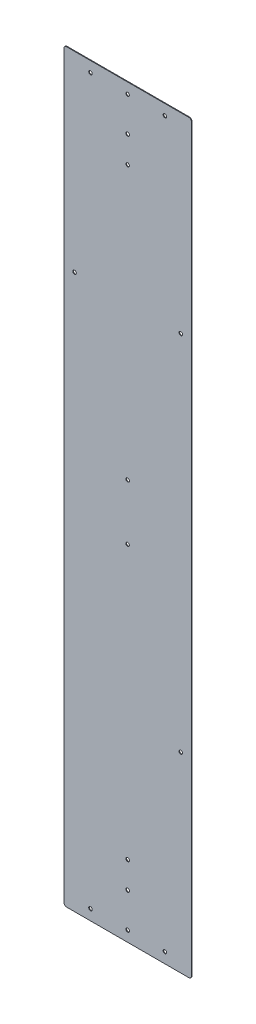
ISO-10303-21;
HEADER;
FILE_DESCRIPTION(('STEP AP214'),'2;1');
FILE_NAME('part.step','',(''),(''),'','','');
FILE_SCHEMA(('AUTOMOTIVE_DESIGN { 1 0 10303 214 1 1 1 1 }'));
ENDSEC;
DATA;
#1=APPLICATION_CONTEXT('core data for automotive mechanical design processes');
#2=APPLICATION_PROTOCOL_DEFINITION('international standard','automotive_design',2000,#1);
#3=PRODUCT_CONTEXT('',#1,'mechanical');
#4=PRODUCT('Part','Part','',(#3));
#5=PRODUCT_RELATED_PRODUCT_CATEGORY('part','',(#4));
#6=PRODUCT_DEFINITION_FORMATION('','',#4);
#7=PRODUCT_DEFINITION_CONTEXT('part definition',#1,'design');
#8=PRODUCT_DEFINITION('design','',#6,#7);
#9=PRODUCT_DEFINITION_SHAPE('','',#8);
#10=(LENGTH_UNIT() NAMED_UNIT(*) SI_UNIT(.MILLI.,.METRE.));
#11=(NAMED_UNIT(*) PLANE_ANGLE_UNIT() SI_UNIT($,.RADIAN.));
#12=(NAMED_UNIT(*) SI_UNIT($,.STERADIAN.) SOLID_ANGLE_UNIT());
#13=UNCERTAINTY_MEASURE_WITH_UNIT(LENGTH_MEASURE(1.E-05),#10,'distance_accuracy_value','');
#14=(GEOMETRIC_REPRESENTATION_CONTEXT(3) GLOBAL_UNCERTAINTY_ASSIGNED_CONTEXT((#13)) GLOBAL_UNIT_ASSIGNED_CONTEXT((#10,
#11,#12)) REPRESENTATION_CONTEXT('',''));
#15=CARTESIAN_POINT('',(0.,0.,0.));
#16=DIRECTION('',(0.,0.,1.));
#17=DIRECTION('',(1.,0.,0.));
#18=AXIS2_PLACEMENT_3D('',#15,#16,#17);
#19=CARTESIAN_POINT('',(152.4,890.5875,1.5875));
#20=DIRECTION('',(-1.,0.,0.));
#21=DIRECTION('',(0.,-1.,0.));
#22=AXIS2_PLACEMENT_3D('',#19,#20,#21);
#23=PLANE('',#22);
#24=DIRECTION('',(0.,1.,0.));
#25=VECTOR('',#24,1.);
#26=CARTESIAN_POINT('',(152.4,890.5875,0.));
#27=LINE('',#26,#25);
#28=CARTESIAN_POINT('',(152.4,-884.2375,0.));
#29=VERTEX_POINT('',#28);
#30=CARTESIAN_POINT('',(152.4,884.2375,0.));
#31=VERTEX_POINT('',#30);
#32=EDGE_CURVE('E128',#29,#31,#27,.T.);
#33=ORIENTED_EDGE('',*,*,#32,.T.);
#34=DIRECTION('',(0.,0.,-1.));
#35=VECTOR('',#34,1.);
#36=CARTESIAN_POINT('',(152.4,884.2375,1.5875));
#37=LINE('',#36,#35);
#38=CARTESIAN_POINT('',(152.4,884.2375,1.5875));
#39=VERTEX_POINT('',#38);
#40=EDGE_CURVE('E151',#31,#39,#37,.F.);
#41=ORIENTED_EDGE('',*,*,#40,.T.);
#42=DIRECTION('',(0.,1.,0.));
#43=VECTOR('',#42,1.);
#44=CARTESIAN_POINT('',(152.4,890.5875,1.5875));
#45=LINE('',#44,#43);
#46=CARTESIAN_POINT('',(152.4,-884.2375,1.5875));
#47=VERTEX_POINT('',#46);
#48=EDGE_CURVE('E126',#47,#39,#45,.T.);
#49=ORIENTED_EDGE('',*,*,#48,.F.);
#50=DIRECTION('',(0.,0.,-1.));
#51=VECTOR('',#50,1.);
#52=CARTESIAN_POINT('',(152.4,-884.2375,1.5875));
#53=LINE('',#52,#51);
#54=EDGE_CURVE('E148',#47,#29,#53,.T.);
#55=ORIENTED_EDGE('',*,*,#54,.T.);
#56=EDGE_LOOP('',(#33,#41,#49,#55));
#57=FACE_BOUND('',#56,.T.);
#58=ADVANCED_FACE('F33',(#57),#23,.F.);
#59=CARTESIAN_POINT('',(-152.4,890.5875,1.5875));
#60=DIRECTION('',(0.,-1.,0.));
#61=DIRECTION('',(0.,0.,-1.));
#62=AXIS2_PLACEMENT_3D('',#59,#60,#61);
#63=PLANE('',#62);
#64=DIRECTION('',(-1.,0.,0.));
#65=VECTOR('',#64,1.);
#66=CARTESIAN_POINT('',(-152.4,890.5875,0.));
#67=LINE('',#66,#65);
#68=CARTESIAN_POINT('',(146.05,890.5875,0.));
#69=VERTEX_POINT('',#68);
#70=CARTESIAN_POINT('',(-146.05,890.5875,0.));
#71=VERTEX_POINT('',#70);
#72=EDGE_CURVE('E124',#69,#71,#67,.T.);
#73=ORIENTED_EDGE('',*,*,#72,.T.);
#74=DIRECTION('',(0.,0.,-1.));
#75=VECTOR('',#74,1.);
#76=CARTESIAN_POINT('',(-146.05,890.5875,1.5875));
#77=LINE('',#76,#75);
#78=CARTESIAN_POINT('',(-146.05,890.5875,1.5875));
#79=VERTEX_POINT('',#78);
#80=EDGE_CURVE('E103',#71,#79,#77,.F.);
#81=ORIENTED_EDGE('',*,*,#80,.T.);
#82=DIRECTION('',(-1.,0.,0.));
#83=VECTOR('',#82,1.);
#84=CARTESIAN_POINT('',(-152.4,890.5875,1.5875));
#85=LINE('',#84,#83);
#86=CARTESIAN_POINT('',(146.05,890.5875,1.5875));
#87=VERTEX_POINT('',#86);
#88=EDGE_CURVE('E167',#87,#79,#85,.T.);
#89=ORIENTED_EDGE('',*,*,#88,.F.);
#90=DIRECTION('',(0.,0.,-1.));
#91=VECTOR('',#90,1.);
#92=CARTESIAN_POINT('',(146.05,890.5875,1.5875));
#93=LINE('',#92,#91);
#94=EDGE_CURVE('E108',#87,#69,#93,.T.);
#95=ORIENTED_EDGE('',*,*,#94,.T.);
#96=EDGE_LOOP('',(#73,#81,#89,#95));
#97=FACE_BOUND('',#96,.T.);
#98=ADVANCED_FACE('F304',(#97),#63,.F.);
#99=CARTESIAN_POINT('',(-152.4,890.5875,1.5875));
#100=DIRECTION('',(1.,0.,0.));
#101=DIRECTION('',(0.,1.,0.));
#102=AXIS2_PLACEMENT_3D('',#99,#100,#101);
#103=PLANE('',#102);
#104=DIRECTION('',(0.,-1.,0.));
#105=VECTOR('',#104,1.);
#106=CARTESIAN_POINT('',(-152.4,890.5875,1.5875));
#107=LINE('',#106,#105);
#108=CARTESIAN_POINT('',(-152.4,884.2375,1.5875));
#109=VERTEX_POINT('',#108);
#110=CARTESIAN_POINT('',(-152.4,-884.2375,1.5875));
#111=VERTEX_POINT('',#110);
#112=EDGE_CURVE('E117',#109,#111,#107,.T.);
#113=ORIENTED_EDGE('',*,*,#112,.F.);
#114=DIRECTION('',(0.,0.,-1.));
#115=VECTOR('',#114,1.);
#116=CARTESIAN_POINT('',(-152.4,884.2375,1.5875));
#117=LINE('',#116,#115);
#118=CARTESIAN_POINT('',(-152.4,884.2375,0.));
#119=VERTEX_POINT('',#118);
#120=EDGE_CURVE('E102',#109,#119,#117,.T.);
#121=ORIENTED_EDGE('',*,*,#120,.T.);
#122=DIRECTION('',(0.,-1.,0.));
#123=VECTOR('',#122,1.);
#124=CARTESIAN_POINT('',(-152.4,890.5875,0.));
#125=LINE('',#124,#123);
#126=CARTESIAN_POINT('',(-152.4,-884.2375,0.));
#127=VERTEX_POINT('',#126);
#128=EDGE_CURVE('E115',#119,#127,#125,.T.);
#129=ORIENTED_EDGE('',*,*,#128,.T.);
#130=DIRECTION('',(0.,0.,-1.));
#131=VECTOR('',#130,1.);
#132=CARTESIAN_POINT('',(-152.4,-884.2375,1.5875));
#133=LINE('',#132,#131);
#134=EDGE_CURVE('E119',#127,#111,#133,.F.);
#135=ORIENTED_EDGE('',*,*,#134,.T.);
#136=EDGE_LOOP('',(#113,#121,#129,#135));
#137=FACE_BOUND('',#136,.T.);
#138=ADVANCED_FACE('F114',(#137),#103,.F.);
#139=CARTESIAN_POINT('',(-152.4,-890.5875,1.5875));
#140=DIRECTION('',(0.,1.,0.));
#141=DIRECTION('',(0.,0.,1.));
#142=AXIS2_PLACEMENT_3D('',#139,#140,#141);
#143=PLANE('',#142);
#144=DIRECTION('',(1.,0.,0.));
#145=VECTOR('',#144,1.);
#146=CARTESIAN_POINT('',(-152.4,-890.5875,0.));
#147=LINE('',#146,#145);
#148=CARTESIAN_POINT('',(-146.05,-890.5875,0.));
#149=VERTEX_POINT('',#148);
#150=CARTESIAN_POINT('',(146.05,-890.5875,0.));
#151=VERTEX_POINT('',#150);
#152=EDGE_CURVE('E123',#149,#151,#147,.T.);
#153=ORIENTED_EDGE('',*,*,#152,.T.);
#154=DIRECTION('',(0.,0.,-1.));
#155=VECTOR('',#154,1.);
#156=CARTESIAN_POINT('',(146.05,-890.5875,1.5875));
#157=LINE('',#156,#155);
#158=CARTESIAN_POINT('',(146.05,-890.5875,1.5875));
#159=VERTEX_POINT('',#158);
#160=EDGE_CURVE('E11',#151,#159,#157,.F.);
#161=ORIENTED_EDGE('',*,*,#160,.T.);
#162=DIRECTION('',(1.,0.,0.));
#163=VECTOR('',#162,1.);
#164=CARTESIAN_POINT('',(-152.4,-890.5875,1.5875));
#165=LINE('',#164,#163);
#166=CARTESIAN_POINT('',(-146.05,-890.5875,1.5875));
#167=VERTEX_POINT('',#166);
#168=EDGE_CURVE('E132',#167,#159,#165,.T.);
#169=ORIENTED_EDGE('',*,*,#168,.F.);
#170=DIRECTION('',(0.,0.,-1.));
#171=VECTOR('',#170,1.);
#172=CARTESIAN_POINT('',(-146.05,-890.5875,1.5875));
#173=LINE('',#172,#171);
#174=EDGE_CURVE('E41',#167,#149,#173,.T.);
#175=ORIENTED_EDGE('',*,*,#174,.T.);
#176=EDGE_LOOP('',(#153,#161,#169,#175));
#177=FACE_BOUND('',#176,.T.);
#178=ADVANCED_FACE('F154',(#177),#143,.F.);
#179=CARTESIAN_POINT('',(0.,0.,1.5875));
#180=DIRECTION('',(0.,0.,1.));
#181=DIRECTION('',(1.,0.,0.));
#182=AXIS2_PLACEMENT_3D('',#179,#180,#181);
#183=PLANE('',#182);
#184=CARTESIAN_POINT('',(0.,865.1875,1.5875));
#185=DIRECTION('',(0.,0.,1.));
#186=DIRECTION('',(1.,0.,0.));
#187=AXIS2_PLACEMENT_3D('',#184,#185,#186);
#188=CIRCLE('',#187,4.2164);
#189=CARTESIAN_POINT('',(4.2164,865.1875,1.5875));
#190=VERTEX_POINT('',#189);
#191=EDGE_CURVE('E265',#190,#190,#188,.T.);
#192=ORIENTED_EDGE('',*,*,#191,.F.);
#193=EDGE_LOOP('',(#192));
#194=FACE_BOUND('',#193,.T.);
#195=CARTESIAN_POINT('',(-127.,433.3875,1.5875));
#196=DIRECTION('',(0.,0.,1.));
#197=DIRECTION('',(1.,0.,0.));
#198=AXIS2_PLACEMENT_3D('',#195,#196,#197);
#199=CIRCLE('',#198,4.21639999999999);
#200=CARTESIAN_POINT('',(-122.7836,433.3875,1.5875));
#201=VERTEX_POINT('',#200);
#202=EDGE_CURVE('E259',#201,#201,#199,.T.);
#203=ORIENTED_EDGE('',*,*,#202,.F.);
#204=EDGE_LOOP('',(#203));
#205=FACE_BOUND('',#204,.T.);
#206=CARTESIAN_POINT('',(127.,433.3875,1.5875));
#207=DIRECTION('',(0.,0.,1.));
#208=DIRECTION('',(1.,0.,0.));
#209=AXIS2_PLACEMENT_3D('',#206,#207,#208);
#210=CIRCLE('',#209,4.21640000000001);
#211=CARTESIAN_POINT('',(131.2164,433.3875,1.5875));
#212=VERTEX_POINT('',#211);
#213=EDGE_CURVE('E253',#212,#212,#210,.T.);
#214=ORIENTED_EDGE('',*,*,#213,.F.);
#215=EDGE_LOOP('',(#214));
#216=FACE_BOUND('',#215,.T.);
#217=CARTESIAN_POINT('',(0.,66.675,1.5875));
#218=DIRECTION('',(0.,0.,1.));
#219=DIRECTION('',(1.,0.,0.));
#220=AXIS2_PLACEMENT_3D('',#217,#218,#219);
#221=CIRCLE('',#220,4.2164);
#222=CARTESIAN_POINT('',(4.2164,66.675,1.5875));
#223=VERTEX_POINT('',#222);
#224=EDGE_CURVE('E247',#223,#223,#221,.T.);
#225=ORIENTED_EDGE('',*,*,#224,.F.);
#226=EDGE_LOOP('',(#225));
#227=FACE_BOUND('',#226,.T.);
#228=CARTESIAN_POINT('',(0.,-66.6749999999998,1.5875));
#229=DIRECTION('',(0.,0.,1.));
#230=DIRECTION('',(1.,0.,0.));
#231=AXIS2_PLACEMENT_3D('',#228,#229,#230);
#232=CIRCLE('',#231,4.2164);
#233=CARTESIAN_POINT('',(4.2164,-66.6749999999998,1.5875));
#234=VERTEX_POINT('',#233);
#235=EDGE_CURVE('E241',#234,#234,#232,.T.);
#236=ORIENTED_EDGE('',*,*,#235,.F.);
#237=EDGE_LOOP('',(#236));
#238=FACE_BOUND('',#237,.T.);
#239=CARTESIAN_POINT('',(127.,-433.3875,1.5875));
#240=DIRECTION('',(0.,0.,1.));
#241=DIRECTION('',(1.,0.,0.));
#242=AXIS2_PLACEMENT_3D('',#239,#240,#241);
#243=CIRCLE('',#242,4.21640000000001);
#244=CARTESIAN_POINT('',(131.2164,-433.3875,1.5875));
#245=VERTEX_POINT('',#244);
#246=EDGE_CURVE('E235',#245,#245,#243,.T.);
#247=ORIENTED_EDGE('',*,*,#246,.F.);
#248=EDGE_LOOP('',(#247));
#249=FACE_BOUND('',#248,.T.);
#250=CARTESIAN_POINT('',(0.,-865.1875,1.5875));
#251=DIRECTION('',(0.,0.,1.));
#252=DIRECTION('',(1.,0.,0.));
#253=AXIS2_PLACEMENT_3D('',#250,#251,#252);
#254=CIRCLE('',#253,4.2164);
#255=CARTESIAN_POINT('',(4.2164,-865.1875,1.5875));
#256=VERTEX_POINT('',#255);
#257=EDGE_CURVE('E229',#256,#256,#254,.T.);
#258=ORIENTED_EDGE('',*,*,#257,.F.);
#259=EDGE_LOOP('',(#258));
#260=FACE_BOUND('',#259,.T.);
#261=CARTESIAN_POINT('',(0.,782.6375,1.5875));
#262=DIRECTION('',(0.,0.,1.));
#263=DIRECTION('',(1.,0.,0.));
#264=AXIS2_PLACEMENT_3D('',#261,#262,#263);
#265=CIRCLE('',#264,4.2164);
#266=CARTESIAN_POINT('',(4.2164,782.6375,1.5875));
#267=VERTEX_POINT('',#266);
#268=EDGE_CURVE('E223',#267,#267,#265,.T.);
#269=ORIENTED_EDGE('',*,*,#268,.F.);
#270=EDGE_LOOP('',(#269));
#271=FACE_BOUND('',#270,.T.);
#272=CARTESIAN_POINT('',(0.,719.1375,1.5875));
#273=DIRECTION('',(0.,0.,1.));
#274=DIRECTION('',(1.,0.,0.));
#275=AXIS2_PLACEMENT_3D('',#272,#273,#274);
#276=CIRCLE('',#275,4.2164);
#277=CARTESIAN_POINT('',(4.2164,719.1375,1.5875));
#278=VERTEX_POINT('',#277);
#279=EDGE_CURVE('E217',#278,#278,#276,.T.);
#280=ORIENTED_EDGE('',*,*,#279,.F.);
#281=EDGE_LOOP('',(#280));
#282=FACE_BOUND('',#281,.T.);
#283=CARTESIAN_POINT('',(0.,-782.6375,1.5875));
#284=DIRECTION('',(0.,0.,1.));
#285=DIRECTION('',(1.,0.,0.));
#286=AXIS2_PLACEMENT_3D('',#283,#284,#285);
#287=CIRCLE('',#286,4.2164);
#288=CARTESIAN_POINT('',(4.2164,-782.6375,1.5875));
#289=VERTEX_POINT('',#288);
#290=EDGE_CURVE('E211',#289,#289,#287,.T.);
#291=ORIENTED_EDGE('',*,*,#290,.F.);
#292=EDGE_LOOP('',(#291));
#293=FACE_BOUND('',#292,.T.);
#294=CARTESIAN_POINT('',(0.,-719.1375,1.5875));
#295=DIRECTION('',(0.,0.,1.));
#296=DIRECTION('',(1.,0.,0.));
#297=AXIS2_PLACEMENT_3D('',#294,#295,#296);
#298=CIRCLE('',#297,4.2164);
#299=CARTESIAN_POINT('',(4.2164,-719.1375,1.5875));
#300=VERTEX_POINT('',#299);
#301=EDGE_CURVE('E205',#300,#300,#298,.T.);
#302=ORIENTED_EDGE('',*,*,#301,.F.);
#303=EDGE_LOOP('',(#302));
#304=FACE_BOUND('',#303,.T.);
#305=CARTESIAN_POINT('',(-88.9,865.1875,1.5875));
#306=DIRECTION('',(0.,0.,1.));
#307=DIRECTION('',(1.,0.,0.));
#308=AXIS2_PLACEMENT_3D('',#305,#306,#307);
#309=CIRCLE('',#308,4.21639999999999);
#310=CARTESIAN_POINT('',(-84.6836,865.1875,1.5875));
#311=VERTEX_POINT('',#310);
#312=EDGE_CURVE('E199',#311,#311,#309,.T.);
#313=ORIENTED_EDGE('',*,*,#312,.F.);
#314=EDGE_LOOP('',(#313));
#315=FACE_BOUND('',#314,.T.);
#316=CARTESIAN_POINT('',(88.9,865.1875,1.5875));
#317=DIRECTION('',(0.,0.,1.));
#318=DIRECTION('',(1.,0.,0.));
#319=AXIS2_PLACEMENT_3D('',#316,#317,#318);
#320=CIRCLE('',#319,4.21639999999999);
#321=CARTESIAN_POINT('',(93.1164,865.1875,1.5875));
#322=VERTEX_POINT('',#321);
#323=EDGE_CURVE('E193',#322,#322,#320,.T.);
#324=ORIENTED_EDGE('',*,*,#323,.F.);
#325=EDGE_LOOP('',(#324));
#326=FACE_BOUND('',#325,.T.);
#327=CARTESIAN_POINT('',(-88.8999999999989,-865.1875,1.5875));
#328=DIRECTION('',(0.,0.,1.));
#329=DIRECTION('',(1.,0.,0.));
#330=AXIS2_PLACEMENT_3D('',#327,#328,#329);
#331=CIRCLE('',#330,4.21639999999999);
#332=CARTESIAN_POINT('',(-84.6835999999989,-865.1875,1.5875));
#333=VERTEX_POINT('',#332);
#334=EDGE_CURVE('E185',#333,#333,#331,.T.);
#335=ORIENTED_EDGE('',*,*,#334,.F.);
#336=EDGE_LOOP('',(#335));
#337=FACE_BOUND('',#336,.T.);
#338=CARTESIAN_POINT('',(88.9,-865.1875,1.5875));
#339=DIRECTION('',(0.,0.,1.));
#340=DIRECTION('',(1.,0.,0.));
#341=AXIS2_PLACEMENT_3D('',#338,#339,#340);
#342=CIRCLE('',#341,4.21639999999999);
#343=CARTESIAN_POINT('',(93.1164,-865.1875,1.5875));
#344=VERTEX_POINT('',#343);
#345=EDGE_CURVE('E177',#344,#344,#342,.T.);
#346=ORIENTED_EDGE('',*,*,#345,.F.);
#347=EDGE_LOOP('',(#346));
#348=FACE_BOUND('',#347,.T.);
#349=ORIENTED_EDGE('',*,*,#88,.T.);
#350=CARTESIAN_POINT('',(-146.05,884.2375,1.5875));
#351=DIRECTION('',(0.,0.,1.));
#352=DIRECTION('',(1.,0.,0.));
#353=AXIS2_PLACEMENT_3D('',#350,#351,#352);
#354=CIRCLE('',#353,6.35);
#355=EDGE_CURVE('E146',#79,#109,#354,.T.);
#356=ORIENTED_EDGE('',*,*,#355,.T.);
#357=ORIENTED_EDGE('',*,*,#112,.T.);
#358=CARTESIAN_POINT('',(-146.05,-884.2375,1.5875));
#359=DIRECTION('',(0.,0.,1.));
#360=DIRECTION('',(1.,0.,0.));
#361=AXIS2_PLACEMENT_3D('',#358,#359,#360);
#362=CIRCLE('',#361,6.35);
#363=EDGE_CURVE('E53',#111,#167,#362,.T.);
#364=ORIENTED_EDGE('',*,*,#363,.T.);
#365=ORIENTED_EDGE('',*,*,#168,.T.);
#366=CARTESIAN_POINT('',(146.05,-884.2375,1.5875));
#367=DIRECTION('',(0.,0.,1.));
#368=DIRECTION('',(1.,0.,0.));
#369=AXIS2_PLACEMENT_3D('',#366,#367,#368);
#370=CIRCLE('',#369,6.35);
#371=EDGE_CURVE('E142',#159,#47,#370,.T.);
#372=ORIENTED_EDGE('',*,*,#371,.T.);
#373=ORIENTED_EDGE('',*,*,#48,.T.);
#374=CARTESIAN_POINT('',(146.05,884.2375,1.5875));
#375=DIRECTION('',(0.,0.,1.));
#376=DIRECTION('',(1.,0.,0.));
#377=AXIS2_PLACEMENT_3D('',#374,#375,#376);
#378=CIRCLE('',#377,6.35);
#379=EDGE_CURVE('E144',#39,#87,#378,.T.);
#380=ORIENTED_EDGE('',*,*,#379,.T.);
#381=EDGE_LOOP('',(#349,#356,#357,#364,#365,#372,#373,#380));
#382=FACE_BOUND('',#381,.T.);
#383=ADVANCED_FACE('F271',(#194,#205,#216,#227,#238,#249,#260,#271,#282,#293,#304,#315,#326,
#337,#348,#382),#183,.T.);
#384=CARTESIAN_POINT('',(0.,0.,0.));
#385=DIRECTION('',(0.,0.,1.));
#386=DIRECTION('',(1.,0.,0.));
#387=AXIS2_PLACEMENT_3D('',#384,#385,#386);
#388=PLANE('',#387);
#389=CARTESIAN_POINT('',(0.,865.1875,0.));
#390=DIRECTION('',(0.,0.,1.));
#391=DIRECTION('',(1.,0.,0.));
#392=AXIS2_PLACEMENT_3D('',#389,#390,#391);
#393=CIRCLE('',#392,4.2164);
#394=CARTESIAN_POINT('',(4.2164,865.1875,0.));
#395=VERTEX_POINT('',#394);
#396=EDGE_CURVE('E262',#395,#395,#393,.T.);
#397=ORIENTED_EDGE('',*,*,#396,.T.);
#398=EDGE_LOOP('',(#397));
#399=FACE_BOUND('',#398,.T.);
#400=CARTESIAN_POINT('',(-127.,433.3875,0.));
#401=DIRECTION('',(0.,0.,1.));
#402=DIRECTION('',(1.,0.,0.));
#403=AXIS2_PLACEMENT_3D('',#400,#401,#402);
#404=CIRCLE('',#403,4.21639999999999);
#405=CARTESIAN_POINT('',(-122.7836,433.3875,0.));
#406=VERTEX_POINT('',#405);
#407=EDGE_CURVE('E256',#406,#406,#404,.T.);
#408=ORIENTED_EDGE('',*,*,#407,.T.);
#409=EDGE_LOOP('',(#408));
#410=FACE_BOUND('',#409,.T.);
#411=CARTESIAN_POINT('',(127.,433.3875,0.));
#412=DIRECTION('',(0.,0.,1.));
#413=DIRECTION('',(1.,0.,0.));
#414=AXIS2_PLACEMENT_3D('',#411,#412,#413);
#415=CIRCLE('',#414,4.21640000000001);
#416=CARTESIAN_POINT('',(131.2164,433.3875,0.));
#417=VERTEX_POINT('',#416);
#418=EDGE_CURVE('E250',#417,#417,#415,.T.);
#419=ORIENTED_EDGE('',*,*,#418,.T.);
#420=EDGE_LOOP('',(#419));
#421=FACE_BOUND('',#420,.T.);
#422=CARTESIAN_POINT('',(0.,66.675,0.));
#423=DIRECTION('',(0.,0.,1.));
#424=DIRECTION('',(1.,0.,0.));
#425=AXIS2_PLACEMENT_3D('',#422,#423,#424);
#426=CIRCLE('',#425,4.2164);
#427=CARTESIAN_POINT('',(4.2164,66.675,0.));
#428=VERTEX_POINT('',#427);
#429=EDGE_CURVE('E244',#428,#428,#426,.T.);
#430=ORIENTED_EDGE('',*,*,#429,.T.);
#431=EDGE_LOOP('',(#430));
#432=FACE_BOUND('',#431,.T.);
#433=CARTESIAN_POINT('',(0.,-66.6749999999998,0.));
#434=DIRECTION('',(0.,0.,1.));
#435=DIRECTION('',(1.,0.,0.));
#436=AXIS2_PLACEMENT_3D('',#433,#434,#435);
#437=CIRCLE('',#436,4.2164);
#438=CARTESIAN_POINT('',(4.2164,-66.6749999999998,0.));
#439=VERTEX_POINT('',#438);
#440=EDGE_CURVE('E238',#439,#439,#437,.T.);
#441=ORIENTED_EDGE('',*,*,#440,.T.);
#442=EDGE_LOOP('',(#441));
#443=FACE_BOUND('',#442,.T.);
#444=CARTESIAN_POINT('',(127.,-433.3875,0.));
#445=DIRECTION('',(0.,0.,1.));
#446=DIRECTION('',(1.,0.,0.));
#447=AXIS2_PLACEMENT_3D('',#444,#445,#446);
#448=CIRCLE('',#447,4.21640000000001);
#449=CARTESIAN_POINT('',(131.2164,-433.3875,0.));
#450=VERTEX_POINT('',#449);
#451=EDGE_CURVE('E232',#450,#450,#448,.T.);
#452=ORIENTED_EDGE('',*,*,#451,.T.);
#453=EDGE_LOOP('',(#452));
#454=FACE_BOUND('',#453,.T.);
#455=CARTESIAN_POINT('',(0.,-865.1875,0.));
#456=DIRECTION('',(0.,0.,1.));
#457=DIRECTION('',(1.,0.,0.));
#458=AXIS2_PLACEMENT_3D('',#455,#456,#457);
#459=CIRCLE('',#458,4.2164);
#460=CARTESIAN_POINT('',(4.2164,-865.1875,0.));
#461=VERTEX_POINT('',#460);
#462=EDGE_CURVE('E226',#461,#461,#459,.T.);
#463=ORIENTED_EDGE('',*,*,#462,.T.);
#464=EDGE_LOOP('',(#463));
#465=FACE_BOUND('',#464,.T.);
#466=CARTESIAN_POINT('',(0.,782.6375,0.));
#467=DIRECTION('',(0.,0.,1.));
#468=DIRECTION('',(1.,0.,0.));
#469=AXIS2_PLACEMENT_3D('',#466,#467,#468);
#470=CIRCLE('',#469,4.2164);
#471=CARTESIAN_POINT('',(4.2164,782.6375,0.));
#472=VERTEX_POINT('',#471);
#473=EDGE_CURVE('E220',#472,#472,#470,.T.);
#474=ORIENTED_EDGE('',*,*,#473,.T.);
#475=EDGE_LOOP('',(#474));
#476=FACE_BOUND('',#475,.T.);
#477=CARTESIAN_POINT('',(0.,719.1375,0.));
#478=DIRECTION('',(0.,0.,1.));
#479=DIRECTION('',(1.,0.,0.));
#480=AXIS2_PLACEMENT_3D('',#477,#478,#479);
#481=CIRCLE('',#480,4.2164);
#482=CARTESIAN_POINT('',(4.2164,719.1375,0.));
#483=VERTEX_POINT('',#482);
#484=EDGE_CURVE('E214',#483,#483,#481,.T.);
#485=ORIENTED_EDGE('',*,*,#484,.T.);
#486=EDGE_LOOP('',(#485));
#487=FACE_BOUND('',#486,.T.);
#488=CARTESIAN_POINT('',(0.,-782.6375,0.));
#489=DIRECTION('',(0.,0.,1.));
#490=DIRECTION('',(1.,0.,0.));
#491=AXIS2_PLACEMENT_3D('',#488,#489,#490);
#492=CIRCLE('',#491,4.2164);
#493=CARTESIAN_POINT('',(4.2164,-782.6375,0.));
#494=VERTEX_POINT('',#493);
#495=EDGE_CURVE('E208',#494,#494,#492,.T.);
#496=ORIENTED_EDGE('',*,*,#495,.T.);
#497=EDGE_LOOP('',(#496));
#498=FACE_BOUND('',#497,.T.);
#499=CARTESIAN_POINT('',(0.,-719.1375,0.));
#500=DIRECTION('',(0.,0.,1.));
#501=DIRECTION('',(1.,0.,0.));
#502=AXIS2_PLACEMENT_3D('',#499,#500,#501);
#503=CIRCLE('',#502,4.2164);
#504=CARTESIAN_POINT('',(4.2164,-719.1375,0.));
#505=VERTEX_POINT('',#504);
#506=EDGE_CURVE('E202',#505,#505,#503,.T.);
#507=ORIENTED_EDGE('',*,*,#506,.T.);
#508=EDGE_LOOP('',(#507));
#509=FACE_BOUND('',#508,.T.);
#510=CARTESIAN_POINT('',(-88.9,865.1875,0.));
#511=DIRECTION('',(0.,0.,1.));
#512=DIRECTION('',(1.,0.,0.));
#513=AXIS2_PLACEMENT_3D('',#510,#511,#512);
#514=CIRCLE('',#513,4.21639999999999);
#515=CARTESIAN_POINT('',(-84.6836,865.1875,0.));
#516=VERTEX_POINT('',#515);
#517=EDGE_CURVE('E196',#516,#516,#514,.T.);
#518=ORIENTED_EDGE('',*,*,#517,.T.);
#519=EDGE_LOOP('',(#518));
#520=FACE_BOUND('',#519,.T.);
#521=CARTESIAN_POINT('',(88.9,865.1875,0.));
#522=DIRECTION('',(0.,0.,1.));
#523=DIRECTION('',(1.,0.,0.));
#524=AXIS2_PLACEMENT_3D('',#521,#522,#523);
#525=CIRCLE('',#524,4.21639999999999);
#526=CARTESIAN_POINT('',(93.1164,865.1875,0.));
#527=VERTEX_POINT('',#526);
#528=EDGE_CURVE('E190',#527,#527,#525,.T.);
#529=ORIENTED_EDGE('',*,*,#528,.T.);
#530=EDGE_LOOP('',(#529));
#531=FACE_BOUND('',#530,.T.);
#532=CARTESIAN_POINT('',(-88.8999999999989,-865.1875,0.));
#533=DIRECTION('',(0.,0.,1.));
#534=DIRECTION('',(1.,0.,0.));
#535=AXIS2_PLACEMENT_3D('',#532,#533,#534);
#536=CIRCLE('',#535,4.21639999999999);
#537=CARTESIAN_POINT('',(-84.6835999999989,-865.1875,0.));
#538=VERTEX_POINT('',#537);
#539=EDGE_CURVE('E181',#538,#538,#536,.T.);
#540=ORIENTED_EDGE('',*,*,#539,.T.);
#541=EDGE_LOOP('',(#540));
#542=FACE_BOUND('',#541,.T.);
#543=CARTESIAN_POINT('',(88.9,-865.1875,0.));
#544=DIRECTION('',(0.,0.,1.));
#545=DIRECTION('',(1.,0.,0.));
#546=AXIS2_PLACEMENT_3D('',#543,#544,#545);
#547=CIRCLE('',#546,4.21639999999999);
#548=CARTESIAN_POINT('',(93.1164,-865.1875,0.));
#549=VERTEX_POINT('',#548);
#550=EDGE_CURVE('E172',#549,#549,#547,.T.);
#551=ORIENTED_EDGE('',*,*,#550,.T.);
#552=EDGE_LOOP('',(#551));
#553=FACE_BOUND('',#552,.T.);
#554=ORIENTED_EDGE('',*,*,#128,.F.);
#555=CARTESIAN_POINT('',(-146.05,884.2375,0.));
#556=DIRECTION('',(0.,0.,1.));
#557=DIRECTION('',(1.,0.,0.));
#558=AXIS2_PLACEMENT_3D('',#555,#556,#557);
#559=CIRCLE('',#558,6.35);
#560=EDGE_CURVE('E98',#119,#71,#559,.F.);
#561=ORIENTED_EDGE('',*,*,#560,.T.);
#562=ORIENTED_EDGE('',*,*,#72,.F.);
#563=CARTESIAN_POINT('',(146.05,884.2375,0.));
#564=DIRECTION('',(0.,0.,1.));
#565=DIRECTION('',(1.,0.,0.));
#566=AXIS2_PLACEMENT_3D('',#563,#564,#565);
#567=CIRCLE('',#566,6.35);
#568=EDGE_CURVE('E109',#69,#31,#567,.F.);
#569=ORIENTED_EDGE('',*,*,#568,.T.);
#570=ORIENTED_EDGE('',*,*,#32,.F.);
#571=CARTESIAN_POINT('',(146.05,-884.2375,0.));
#572=DIRECTION('',(0.,0.,1.));
#573=DIRECTION('',(1.,0.,0.));
#574=AXIS2_PLACEMENT_3D('',#571,#572,#573);
#575=CIRCLE('',#574,6.35);
#576=EDGE_CURVE('E135',#29,#151,#575,.F.);
#577=ORIENTED_EDGE('',*,*,#576,.T.);
#578=ORIENTED_EDGE('',*,*,#152,.F.);
#579=CARTESIAN_POINT('',(-146.05,-884.2375,0.));
#580=DIRECTION('',(0.,0.,1.));
#581=DIRECTION('',(1.,0.,0.));
#582=AXIS2_PLACEMENT_3D('',#579,#580,#581);
#583=CIRCLE('',#582,6.35);
#584=EDGE_CURVE('E118',#149,#127,#583,.F.);
#585=ORIENTED_EDGE('',*,*,#584,.T.);
#586=EDGE_LOOP('',(#554,#561,#562,#569,#570,#577,#578,#585));
#587=FACE_BOUND('',#586,.T.);
#588=ADVANCED_FACE('F121',(#399,#410,#421,#432,#443,#454,#465,#476,#487,#498,#509,#520,#531,
#542,#553,#587),#388,.F.);
#589=CARTESIAN_POINT('',(88.9,-865.1875,1.5875));
#590=DIRECTION('',(0.,0.,1.));
#591=DIRECTION('',(1.,0.,0.));
#592=AXIS2_PLACEMENT_3D('',#589,#590,#591);
#593=CYLINDRICAL_SURFACE('',#592,4.21639999999999);
#594=ORIENTED_EDGE('',*,*,#550,.F.);
#595=EDGE_LOOP('',(#594));
#596=FACE_BOUND('',#595,.T.);
#597=ORIENTED_EDGE('',*,*,#345,.T.);
#598=EDGE_LOOP('',(#597));
#599=FACE_BOUND('',#598,.T.);
#600=ADVANCED_FACE('F326',(#596,#599),#593,.F.);
#601=CARTESIAN_POINT('',(-88.8999999999989,-865.1875,1.5875));
#602=DIRECTION('',(0.,0.,1.));
#603=DIRECTION('',(1.,0.,0.));
#604=AXIS2_PLACEMENT_3D('',#601,#602,#603);
#605=CYLINDRICAL_SURFACE('',#604,4.21639999999999);
#606=ORIENTED_EDGE('',*,*,#539,.F.);
#607=EDGE_LOOP('',(#606));
#608=FACE_BOUND('',#607,.T.);
#609=ORIENTED_EDGE('',*,*,#334,.T.);
#610=EDGE_LOOP('',(#609));
#611=FACE_BOUND('',#610,.T.);
#612=ADVANCED_FACE('F331',(#608,#611),#605,.F.);
#613=CARTESIAN_POINT('',(88.9,865.1875,1.5875));
#614=DIRECTION('',(0.,0.,1.));
#615=DIRECTION('',(1.,0.,0.));
#616=AXIS2_PLACEMENT_3D('',#613,#614,#615);
#617=CYLINDRICAL_SURFACE('',#616,4.21639999999999);
#618=ORIENTED_EDGE('',*,*,#528,.F.);
#619=EDGE_LOOP('',(#618));
#620=FACE_BOUND('',#619,.T.);
#621=ORIENTED_EDGE('',*,*,#323,.T.);
#622=EDGE_LOOP('',(#621));
#623=FACE_BOUND('',#622,.T.);
#624=ADVANCED_FACE('F335',(#620,#623),#617,.F.);
#625=CARTESIAN_POINT('',(-88.9,865.1875,1.5875));
#626=DIRECTION('',(0.,0.,1.));
#627=DIRECTION('',(1.,0.,0.));
#628=AXIS2_PLACEMENT_3D('',#625,#626,#627);
#629=CYLINDRICAL_SURFACE('',#628,4.21639999999999);
#630=ORIENTED_EDGE('',*,*,#517,.F.);
#631=EDGE_LOOP('',(#630));
#632=FACE_BOUND('',#631,.T.);
#633=ORIENTED_EDGE('',*,*,#312,.T.);
#634=EDGE_LOOP('',(#633));
#635=FACE_BOUND('',#634,.T.);
#636=ADVANCED_FACE('F339',(#632,#635),#629,.F.);
#637=CARTESIAN_POINT('',(0.,-719.1375,1.5875));
#638=DIRECTION('',(0.,0.,1.));
#639=DIRECTION('',(1.,0.,0.));
#640=AXIS2_PLACEMENT_3D('',#637,#638,#639);
#641=CYLINDRICAL_SURFACE('',#640,4.2164);
#642=ORIENTED_EDGE('',*,*,#506,.F.);
#643=EDGE_LOOP('',(#642));
#644=FACE_BOUND('',#643,.T.);
#645=ORIENTED_EDGE('',*,*,#301,.T.);
#646=EDGE_LOOP('',(#645));
#647=FACE_BOUND('',#646,.T.);
#648=ADVANCED_FACE('F343',(#644,#647),#641,.F.);
#649=CARTESIAN_POINT('',(0.,-782.6375,1.5875));
#650=DIRECTION('',(0.,0.,1.));
#651=DIRECTION('',(1.,0.,0.));
#652=AXIS2_PLACEMENT_3D('',#649,#650,#651);
#653=CYLINDRICAL_SURFACE('',#652,4.2164);
#654=ORIENTED_EDGE('',*,*,#495,.F.);
#655=EDGE_LOOP('',(#654));
#656=FACE_BOUND('',#655,.T.);
#657=ORIENTED_EDGE('',*,*,#290,.T.);
#658=EDGE_LOOP('',(#657));
#659=FACE_BOUND('',#658,.T.);
#660=ADVANCED_FACE('F347',(#656,#659),#653,.F.);
#661=CARTESIAN_POINT('',(0.,719.1375,1.5875));
#662=DIRECTION('',(0.,0.,1.));
#663=DIRECTION('',(1.,0.,0.));
#664=AXIS2_PLACEMENT_3D('',#661,#662,#663);
#665=CYLINDRICAL_SURFACE('',#664,4.2164);
#666=ORIENTED_EDGE('',*,*,#484,.F.);
#667=EDGE_LOOP('',(#666));
#668=FACE_BOUND('',#667,.T.);
#669=ORIENTED_EDGE('',*,*,#279,.T.);
#670=EDGE_LOOP('',(#669));
#671=FACE_BOUND('',#670,.T.);
#672=ADVANCED_FACE('F351',(#668,#671),#665,.F.);
#673=CARTESIAN_POINT('',(0.,782.6375,1.5875));
#674=DIRECTION('',(0.,0.,1.));
#675=DIRECTION('',(1.,0.,0.));
#676=AXIS2_PLACEMENT_3D('',#673,#674,#675);
#677=CYLINDRICAL_SURFACE('',#676,4.2164);
#678=ORIENTED_EDGE('',*,*,#473,.F.);
#679=EDGE_LOOP('',(#678));
#680=FACE_BOUND('',#679,.T.);
#681=ORIENTED_EDGE('',*,*,#268,.T.);
#682=EDGE_LOOP('',(#681));
#683=FACE_BOUND('',#682,.T.);
#684=ADVANCED_FACE('F355',(#680,#683),#677,.F.);
#685=CARTESIAN_POINT('',(0.,-865.1875,1.5875));
#686=DIRECTION('',(0.,0.,1.));
#687=DIRECTION('',(1.,0.,0.));
#688=AXIS2_PLACEMENT_3D('',#685,#686,#687);
#689=CYLINDRICAL_SURFACE('',#688,4.2164);
#690=ORIENTED_EDGE('',*,*,#462,.F.);
#691=EDGE_LOOP('',(#690));
#692=FACE_BOUND('',#691,.T.);
#693=ORIENTED_EDGE('',*,*,#257,.T.);
#694=EDGE_LOOP('',(#693));
#695=FACE_BOUND('',#694,.T.);
#696=ADVANCED_FACE('F359',(#692,#695),#689,.F.);
#697=CARTESIAN_POINT('',(127.,-433.3875,1.5875));
#698=DIRECTION('',(0.,0.,1.));
#699=DIRECTION('',(1.,0.,0.));
#700=AXIS2_PLACEMENT_3D('',#697,#698,#699);
#701=CYLINDRICAL_SURFACE('',#700,4.21640000000001);
#702=ORIENTED_EDGE('',*,*,#451,.F.);
#703=EDGE_LOOP('',(#702));
#704=FACE_BOUND('',#703,.T.);
#705=ORIENTED_EDGE('',*,*,#246,.T.);
#706=EDGE_LOOP('',(#705));
#707=FACE_BOUND('',#706,.T.);
#708=ADVANCED_FACE('F363',(#704,#707),#701,.F.);
#709=CARTESIAN_POINT('',(0.,-66.6749999999998,1.5875));
#710=DIRECTION('',(0.,0.,1.));
#711=DIRECTION('',(1.,0.,0.));
#712=AXIS2_PLACEMENT_3D('',#709,#710,#711);
#713=CYLINDRICAL_SURFACE('',#712,4.2164);
#714=ORIENTED_EDGE('',*,*,#440,.F.);
#715=EDGE_LOOP('',(#714));
#716=FACE_BOUND('',#715,.T.);
#717=ORIENTED_EDGE('',*,*,#235,.T.);
#718=EDGE_LOOP('',(#717));
#719=FACE_BOUND('',#718,.T.);
#720=ADVANCED_FACE('F367',(#716,#719),#713,.F.);
#721=CARTESIAN_POINT('',(0.,66.675,1.5875));
#722=DIRECTION('',(0.,0.,1.));
#723=DIRECTION('',(1.,0.,0.));
#724=AXIS2_PLACEMENT_3D('',#721,#722,#723);
#725=CYLINDRICAL_SURFACE('',#724,4.2164);
#726=ORIENTED_EDGE('',*,*,#429,.F.);
#727=EDGE_LOOP('',(#726));
#728=FACE_BOUND('',#727,.T.);
#729=ORIENTED_EDGE('',*,*,#224,.T.);
#730=EDGE_LOOP('',(#729));
#731=FACE_BOUND('',#730,.T.);
#732=ADVANCED_FACE('F371',(#728,#731),#725,.F.);
#733=CARTESIAN_POINT('',(127.,433.3875,1.5875));
#734=DIRECTION('',(0.,0.,1.));
#735=DIRECTION('',(1.,0.,0.));
#736=AXIS2_PLACEMENT_3D('',#733,#734,#735);
#737=CYLINDRICAL_SURFACE('',#736,4.21640000000001);
#738=ORIENTED_EDGE('',*,*,#418,.F.);
#739=EDGE_LOOP('',(#738));
#740=FACE_BOUND('',#739,.T.);
#741=ORIENTED_EDGE('',*,*,#213,.T.);
#742=EDGE_LOOP('',(#741));
#743=FACE_BOUND('',#742,.T.);
#744=ADVANCED_FACE('F375',(#740,#743),#737,.F.);
#745=CARTESIAN_POINT('',(-127.,433.3875,1.5875));
#746=DIRECTION('',(0.,0.,1.));
#747=DIRECTION('',(1.,0.,0.));
#748=AXIS2_PLACEMENT_3D('',#745,#746,#747);
#749=CYLINDRICAL_SURFACE('',#748,4.21639999999999);
#750=ORIENTED_EDGE('',*,*,#407,.F.);
#751=EDGE_LOOP('',(#750));
#752=FACE_BOUND('',#751,.T.);
#753=ORIENTED_EDGE('',*,*,#202,.T.);
#754=EDGE_LOOP('',(#753));
#755=FACE_BOUND('',#754,.T.);
#756=ADVANCED_FACE('F379',(#752,#755),#749,.F.);
#757=CARTESIAN_POINT('',(0.,865.1875,1.5875));
#758=DIRECTION('',(0.,0.,1.));
#759=DIRECTION('',(1.,0.,0.));
#760=AXIS2_PLACEMENT_3D('',#757,#758,#759);
#761=CYLINDRICAL_SURFACE('',#760,4.2164);
#762=ORIENTED_EDGE('',*,*,#396,.F.);
#763=EDGE_LOOP('',(#762));
#764=FACE_BOUND('',#763,.T.);
#765=ORIENTED_EDGE('',*,*,#191,.T.);
#766=EDGE_LOOP('',(#765));
#767=FACE_BOUND('',#766,.T.);
#768=ADVANCED_FACE('F269',(#764,#767),#761,.F.);
#769=CARTESIAN_POINT('',(-146.05,884.2375,1.5875));
#770=DIRECTION('',(0.,0.,-1.));
#771=DIRECTION('',(-1.,0.,0.));
#772=AXIS2_PLACEMENT_3D('',#769,#770,#771);
#773=CYLINDRICAL_SURFACE('',#772,6.35);
#774=ORIENTED_EDGE('',*,*,#355,.F.);
#775=ORIENTED_EDGE('',*,*,#80,.F.);
#776=ORIENTED_EDGE('',*,*,#560,.F.);
#777=ORIENTED_EDGE('',*,*,#120,.F.);
#778=EDGE_LOOP('',(#774,#775,#776,#777));
#779=FACE_BOUND('',#778,.T.);
#780=ADVANCED_FACE('F101',(#779),#773,.T.);
#781=CARTESIAN_POINT('',(146.05,884.2375,1.5875));
#782=DIRECTION('',(0.,0.,-1.));
#783=DIRECTION('',(-1.,0.,0.));
#784=AXIS2_PLACEMENT_3D('',#781,#782,#783);
#785=CYLINDRICAL_SURFACE('',#784,6.35);
#786=ORIENTED_EDGE('',*,*,#379,.F.);
#787=ORIENTED_EDGE('',*,*,#40,.F.);
#788=ORIENTED_EDGE('',*,*,#568,.F.);
#789=ORIENTED_EDGE('',*,*,#94,.F.);
#790=EDGE_LOOP('',(#786,#787,#788,#789));
#791=FACE_BOUND('',#790,.T.);
#792=ADVANCED_FACE('F306',(#791),#785,.T.);
#793=CARTESIAN_POINT('',(146.05,-884.2375,1.5875));
#794=DIRECTION('',(0.,0.,-1.));
#795=DIRECTION('',(-1.,0.,0.));
#796=AXIS2_PLACEMENT_3D('',#793,#794,#795);
#797=CYLINDRICAL_SURFACE('',#796,6.35);
#798=ORIENTED_EDGE('',*,*,#371,.F.);
#799=ORIENTED_EDGE('',*,*,#160,.F.);
#800=ORIENTED_EDGE('',*,*,#576,.F.);
#801=ORIENTED_EDGE('',*,*,#54,.F.);
#802=EDGE_LOOP('',(#798,#799,#800,#801));
#803=FACE_BOUND('',#802,.T.);
#804=ADVANCED_FACE('F161',(#803),#797,.T.);
#805=CARTESIAN_POINT('',(-146.05,-884.2375,1.5875));
#806=DIRECTION('',(0.,0.,-1.));
#807=DIRECTION('',(-1.,0.,0.));
#808=AXIS2_PLACEMENT_3D('',#805,#806,#807);
#809=CYLINDRICAL_SURFACE('',#808,6.35);
#810=ORIENTED_EDGE('',*,*,#363,.F.);
#811=ORIENTED_EDGE('',*,*,#134,.F.);
#812=ORIENTED_EDGE('',*,*,#584,.F.);
#813=ORIENTED_EDGE('',*,*,#174,.F.);
#814=EDGE_LOOP('',(#810,#811,#812,#813));
#815=FACE_BOUND('',#814,.T.);
#816=ADVANCED_FACE('F35',(#815),#809,.T.);
#817=CLOSED_SHELL('',(#58,#98,#138,#178,#383,#588,#600,#612,#624,#636,#648,#660,#672,#684,#696,
#708,#720,#732,#744,#756,#768,#780,#792,#804,#816));
#818=MANIFOLD_SOLID_BREP('B2',#817);
#819=ADVANCED_BREP_SHAPE_REPRESENTATION('',(#18,#818),#14);
#820=SHAPE_DEFINITION_REPRESENTATION(#9,#819);
ENDSEC;
END-ISO-10303-21;
